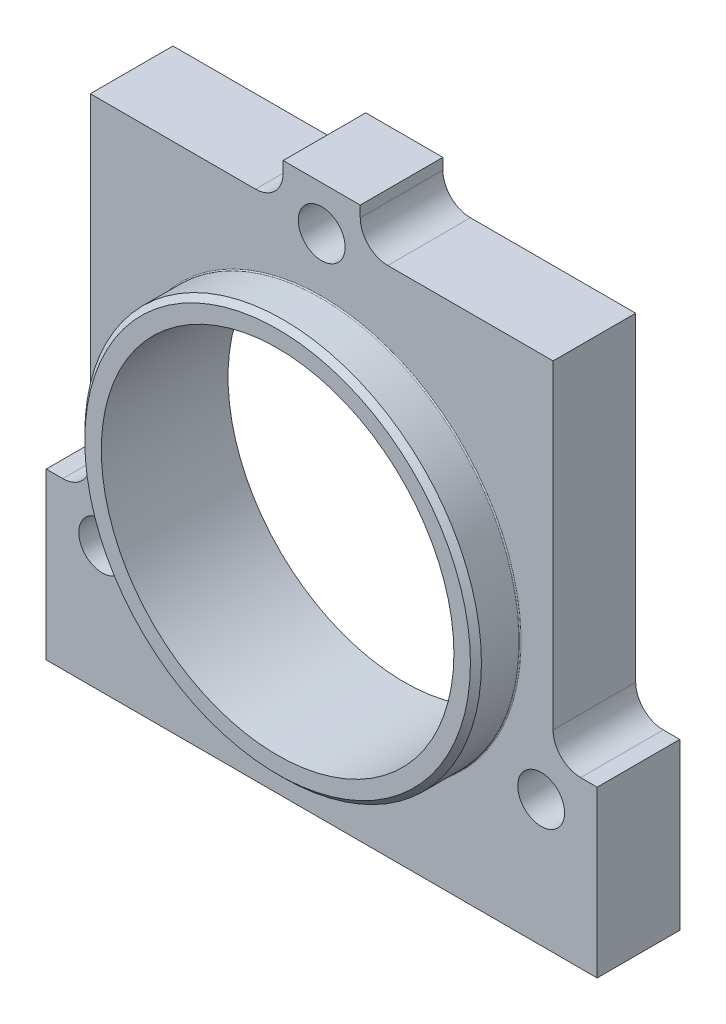
ISO-10303-21;
HEADER;
FILE_DESCRIPTION(('STEP AP214'),'2;1');
FILE_NAME('part.step','',(''),(''),'','','');
FILE_SCHEMA(('AUTOMOTIVE_DESIGN { 1 0 10303 214 1 1 1 1 }'));
ENDSEC;
DATA;
#1=APPLICATION_CONTEXT('core data for automotive mechanical design processes');
#2=APPLICATION_PROTOCOL_DEFINITION('international standard','automotive_design',2000,#1);
#3=PRODUCT_CONTEXT('',#1,'mechanical');
#4=PRODUCT('Part','Part','',(#3));
#5=PRODUCT_RELATED_PRODUCT_CATEGORY('part','',(#4));
#6=PRODUCT_DEFINITION_FORMATION('','',#4);
#7=PRODUCT_DEFINITION_CONTEXT('part definition',#1,'design');
#8=PRODUCT_DEFINITION('design','',#6,#7);
#9=PRODUCT_DEFINITION_SHAPE('','',#8);
#10=(LENGTH_UNIT() NAMED_UNIT(*) SI_UNIT(.MILLI.,.METRE.));
#11=(NAMED_UNIT(*) PLANE_ANGLE_UNIT() SI_UNIT($,.RADIAN.));
#12=(NAMED_UNIT(*) SI_UNIT($,.STERADIAN.) SOLID_ANGLE_UNIT());
#13=UNCERTAINTY_MEASURE_WITH_UNIT(LENGTH_MEASURE(1.E-05),#10,'distance_accuracy_value','');
#14=(GEOMETRIC_REPRESENTATION_CONTEXT(3) GLOBAL_UNCERTAINTY_ASSIGNED_CONTEXT((#13)) GLOBAL_UNIT_ASSIGNED_CONTEXT((#10,
#11,#12)) REPRESENTATION_CONTEXT('',''));
#15=CARTESIAN_POINT('',(0.,0.,0.));
#16=DIRECTION('',(0.,0.,1.));
#17=DIRECTION('',(1.,0.,0.));
#18=AXIS2_PLACEMENT_3D('',#15,#16,#17);
#19=CARTESIAN_POINT('',(-39.8371685740844,-22.9999999999996,23.));
#20=DIRECTION('',(0.,0.,-1.));
#21=DIRECTION('',(-1.,0.,0.));
#22=AXIS2_PLACEMENT_3D('',#19,#20,#21);
#23=CYLINDRICAL_SURFACE('',#22,4.25);
#24=CARTESIAN_POINT('',(-39.8371685740844,-22.9999999999996,15.));
#25=DIRECTION('',(0.,0.,-1.));
#26=DIRECTION('',(-1.,0.,0.));
#27=AXIS2_PLACEMENT_3D('',#24,#25,#26);
#28=CIRCLE('',#27,4.25);
#29=CARTESIAN_POINT('',(-44.0871685740844,-22.9999999999996,15.));
#30=VERTEX_POINT('',#29);
#31=EDGE_CURVE('E269',#30,#30,#28,.T.);
#32=ORIENTED_EDGE('',*,*,#31,.F.);
#33=EDGE_LOOP('',(#32));
#34=FACE_BOUND('',#33,.T.);
#35=CARTESIAN_POINT('',(-39.8371685740844,-22.9999999999996,8.));
#36=DIRECTION('',(0.,0.,-1.));
#37=DIRECTION('',(-1.,0.,0.));
#38=AXIS2_PLACEMENT_3D('',#35,#36,#37);
#39=CIRCLE('',#38,4.25);
#40=CARTESIAN_POINT('',(-44.0871685740844,-22.9999999999996,8.));
#41=VERTEX_POINT('',#40);
#42=EDGE_CURVE('E41',#41,#41,#39,.F.);
#43=ORIENTED_EDGE('',*,*,#42,.F.);
#44=EDGE_LOOP('',(#43));
#45=FACE_BOUND('',#44,.T.);
#46=ADVANCED_FACE('F37',(#34,#45),#23,.F.);
#47=CARTESIAN_POINT('',(39.8371685740841,-23.0000000000002,23.));
#48=DIRECTION('',(0.,0.,-1.));
#49=DIRECTION('',(-1.,0.,0.));
#50=AXIS2_PLACEMENT_3D('',#47,#48,#49);
#51=CYLINDRICAL_SURFACE('',#50,4.25);
#52=CARTESIAN_POINT('',(39.8371685740841,-23.0000000000002,15.));
#53=DIRECTION('',(0.,0.,-1.));
#54=DIRECTION('',(-1.,0.,0.));
#55=AXIS2_PLACEMENT_3D('',#52,#53,#54);
#56=CIRCLE('',#55,4.25);
#57=CARTESIAN_POINT('',(35.5871685740841,-23.0000000000002,15.));
#58=VERTEX_POINT('',#57);
#59=EDGE_CURVE('E274',#58,#58,#56,.T.);
#60=ORIENTED_EDGE('',*,*,#59,.F.);
#61=EDGE_LOOP('',(#60));
#62=FACE_BOUND('',#61,.T.);
#63=CARTESIAN_POINT('',(39.8371685740841,-23.0000000000002,8.));
#64=DIRECTION('',(0.,0.,-1.));
#65=DIRECTION('',(-1.,0.,0.));
#66=AXIS2_PLACEMENT_3D('',#63,#64,#65);
#67=CIRCLE('',#66,4.25);
#68=CARTESIAN_POINT('',(35.5871685740841,-23.0000000000002,8.));
#69=VERTEX_POINT('',#68);
#70=EDGE_CURVE('E267',#69,#69,#67,.F.);
#71=ORIENTED_EDGE('',*,*,#70,.F.);
#72=EDGE_LOOP('',(#71));
#73=FACE_BOUND('',#72,.T.);
#74=ADVANCED_FACE('F355',(#62,#73),#51,.F.);
#75=CARTESIAN_POINT('',(0.,46.,23.));
#76=DIRECTION('',(0.,0.,-1.));
#77=DIRECTION('',(-1.,0.,0.));
#78=AXIS2_PLACEMENT_3D('',#75,#76,#77);
#79=CYLINDRICAL_SURFACE('',#78,4.25);
#80=CARTESIAN_POINT('',(0.,46.,15.));
#81=DIRECTION('',(0.,0.,-1.));
#82=DIRECTION('',(-1.,0.,0.));
#83=AXIS2_PLACEMENT_3D('',#80,#81,#82);
#84=CIRCLE('',#83,4.25);
#85=CARTESIAN_POINT('',(-4.25,46.,15.));
#86=VERTEX_POINT('',#85);
#87=EDGE_CURVE('E265',#86,#86,#84,.T.);
#88=ORIENTED_EDGE('',*,*,#87,.F.);
#89=EDGE_LOOP('',(#88));
#90=FACE_BOUND('',#89,.T.);
#91=CARTESIAN_POINT('',(0.,46.,8.));
#92=DIRECTION('',(0.,0.,-1.));
#93=DIRECTION('',(-1.,0.,0.));
#94=AXIS2_PLACEMENT_3D('',#91,#92,#93);
#95=CIRCLE('',#94,4.25);
#96=CARTESIAN_POINT('',(-4.25,46.,8.));
#97=VERTEX_POINT('',#96);
#98=EDGE_CURVE('E263',#97,#97,#95,.F.);
#99=ORIENTED_EDGE('',*,*,#98,.F.);
#100=EDGE_LOOP('',(#99));
#101=FACE_BOUND('',#100,.T.);
#102=ADVANCED_FACE('F361',(#90,#101),#79,.F.);
#103=CARTESIAN_POINT('',(12.,52.,15.));
#104=DIRECTION('',(0.,0.,-1.));
#105=DIRECTION('',(-1.,0.,0.));
#106=AXIS2_PLACEMENT_3D('',#103,#104,#105);
#107=PLANE('',#106);
#108=ORIENTED_EDGE('',*,*,#31,.T.);
#109=EDGE_LOOP('',(#108));
#110=FACE_BOUND('',#109,.T.);
#111=ORIENTED_EDGE('',*,*,#59,.T.);
#112=EDGE_LOOP('',(#111));
#113=FACE_BOUND('',#112,.T.);
#114=ORIENTED_EDGE('',*,*,#87,.T.);
#115=EDGE_LOOP('',(#114));
#116=FACE_BOUND('',#115,.T.);
#117=CARTESIAN_POINT('',(0.,0.,15.));
#118=DIRECTION('',(0.,0.,-1.));
#119=DIRECTION('',(-1.,0.,0.));
#120=AXIS2_PLACEMENT_3D('',#117,#118,#119);
#121=CIRCLE('',#120,36.2);
#122=CARTESIAN_POINT('',(-36.2,0.,15.));
#123=VERTEX_POINT('',#122);
#124=EDGE_CURVE('E11',#123,#123,#121,.T.);
#125=ORIENTED_EDGE('',*,*,#124,.T.);
#126=EDGE_LOOP('',(#125));
#127=FACE_BOUND('',#126,.T.);
#128=DIRECTION('',(0.,-1.,0.));
#129=VECTOR('',#128,1.);
#130=CARTESIAN_POINT('',(-6.99999999999999,52.,15.));
#131=LINE('',#130,#129);
#132=CARTESIAN_POINT('',(-6.99999999999999,54.,15.));
#133=VERTEX_POINT('',#132);
#134=CARTESIAN_POINT('',(-6.99999999999999,52.,15.));
#135=VERTEX_POINT('',#134);
#136=EDGE_CURVE('E216',#133,#135,#131,.T.);
#137=ORIENTED_EDGE('',*,*,#136,.T.);
#138=CARTESIAN_POINT('',(-12.,52.,15.));
#139=DIRECTION('',(0.,0.,-1.));
#140=DIRECTION('',(1.,0.,0.));
#141=AXIS2_PLACEMENT_3D('',#138,#139,#140);
#142=CIRCLE('',#141,5.);
#143=CARTESIAN_POINT('',(-12.,47.,15.));
#144=VERTEX_POINT('',#143);
#145=EDGE_CURVE('E124',#135,#144,#142,.T.);
#146=ORIENTED_EDGE('',*,*,#145,.T.);
#147=DIRECTION('',(-1.,0.,0.));
#148=VECTOR('',#147,1.);
#149=CARTESIAN_POINT('',(-42.,47.,15.));
#150=LINE('',#149,#148);
#151=CARTESIAN_POINT('',(-42.,47.,15.));
#152=VERTEX_POINT('',#151);
#153=EDGE_CURVE('E303',#144,#152,#150,.T.);
#154=ORIENTED_EDGE('',*,*,#153,.T.);
#155=DIRECTION('',(0.,-1.,0.));
#156=VECTOR('',#155,1.);
#157=CARTESIAN_POINT('',(-42.,-11.,15.));
#158=LINE('',#157,#156);
#159=CARTESIAN_POINT('',(-42.,-11.,15.));
#160=VERTEX_POINT('',#159);
#161=EDGE_CURVE('E305',#152,#160,#158,.T.);
#162=ORIENTED_EDGE('',*,*,#161,.T.);
#163=CARTESIAN_POINT('',(-47.,-11.,15.));
#164=DIRECTION('',(0.,0.,-1.));
#165=DIRECTION('',(1.,0.,0.));
#166=AXIS2_PLACEMENT_3D('',#163,#164,#165);
#167=CIRCLE('',#166,5.);
#168=CARTESIAN_POINT('',(-47.,-16.,15.));
#169=VERTEX_POINT('',#168);
#170=EDGE_CURVE('E307',#160,#169,#167,.T.);
#171=ORIENTED_EDGE('',*,*,#170,.T.);
#172=DIRECTION('',(-1.,0.,0.));
#173=VECTOR('',#172,1.);
#174=CARTESIAN_POINT('',(-50.,-16.,15.));
#175=LINE('',#174,#173);
#176=CARTESIAN_POINT('',(-50.,-16.,15.));
#177=VERTEX_POINT('',#176);
#178=EDGE_CURVE('E309',#169,#177,#175,.T.);
#179=ORIENTED_EDGE('',*,*,#178,.T.);
#180=DIRECTION('',(0.,-1.,0.));
#181=VECTOR('',#180,1.);
#182=CARTESIAN_POINT('',(-50.,-46.,15.));
#183=LINE('',#182,#181);
#184=CARTESIAN_POINT('',(-50.,-46.,15.));
#185=VERTEX_POINT('',#184);
#186=EDGE_CURVE('E311',#177,#185,#183,.T.);
#187=ORIENTED_EDGE('',*,*,#186,.T.);
#188=DIRECTION('',(1.,0.,0.));
#189=VECTOR('',#188,1.);
#190=CARTESIAN_POINT('',(50.,-46.,15.));
#191=LINE('',#190,#189);
#192=CARTESIAN_POINT('',(50.,-46.,15.));
#193=VERTEX_POINT('',#192);
#194=EDGE_CURVE('E313',#185,#193,#191,.T.);
#195=ORIENTED_EDGE('',*,*,#194,.T.);
#196=DIRECTION('',(0.,1.,0.));
#197=VECTOR('',#196,1.);
#198=CARTESIAN_POINT('',(50.,-16.,15.));
#199=LINE('',#198,#197);
#200=CARTESIAN_POINT('',(50.,-16.,15.));
#201=VERTEX_POINT('',#200);
#202=EDGE_CURVE('E315',#193,#201,#199,.T.);
#203=ORIENTED_EDGE('',*,*,#202,.T.);
#204=DIRECTION('',(-1.,0.,0.));
#205=VECTOR('',#204,1.);
#206=CARTESIAN_POINT('',(47.0000000000001,-16.,15.));
#207=LINE('',#206,#205);
#208=CARTESIAN_POINT('',(47.0000000000001,-16.,15.));
#209=VERTEX_POINT('',#208);
#210=EDGE_CURVE('E317',#201,#209,#207,.T.);
#211=ORIENTED_EDGE('',*,*,#210,.T.);
#212=CARTESIAN_POINT('',(47.,-11.,15.));
#213=DIRECTION('',(0.,0.,-1.));
#214=DIRECTION('',(1.,0.,0.));
#215=AXIS2_PLACEMENT_3D('',#212,#213,#214);
#216=CIRCLE('',#215,5.);
#217=CARTESIAN_POINT('',(42.,-11.,15.));
#218=VERTEX_POINT('',#217);
#219=EDGE_CURVE('E319',#209,#218,#216,.T.);
#220=ORIENTED_EDGE('',*,*,#219,.T.);
#221=DIRECTION('',(0.,1.,0.));
#222=VECTOR('',#221,1.);
#223=CARTESIAN_POINT('',(42.,47.,15.));
#224=LINE('',#223,#222);
#225=CARTESIAN_POINT('',(42.,47.,15.));
#226=VERTEX_POINT('',#225);
#227=EDGE_CURVE('E321',#218,#226,#224,.T.);
#228=ORIENTED_EDGE('',*,*,#227,.T.);
#229=DIRECTION('',(-1.,0.,0.));
#230=VECTOR('',#229,1.);
#231=CARTESIAN_POINT('',(12.,47.,15.));
#232=LINE('',#231,#230);
#233=CARTESIAN_POINT('',(12.,47.,15.));
#234=VERTEX_POINT('',#233);
#235=EDGE_CURVE('E167',#226,#234,#232,.T.);
#236=ORIENTED_EDGE('',*,*,#235,.T.);
#237=CARTESIAN_POINT('',(12.,52.,15.));
#238=DIRECTION('',(0.,0.,-1.));
#239=DIRECTION('',(-1.,0.,0.));
#240=AXIS2_PLACEMENT_3D('',#237,#238,#239);
#241=CIRCLE('',#240,5.);
#242=CARTESIAN_POINT('',(7.00000000000001,52.,15.));
#243=VERTEX_POINT('',#242);
#244=EDGE_CURVE('E161',#234,#243,#241,.T.);
#245=ORIENTED_EDGE('',*,*,#244,.T.);
#246=DIRECTION('',(0.,1.,0.));
#247=VECTOR('',#246,1.);
#248=CARTESIAN_POINT('',(7.,54.,15.));
#249=LINE('',#248,#247);
#250=CARTESIAN_POINT('',(7.,54.,15.));
#251=VERTEX_POINT('',#250);
#252=EDGE_CURVE('E165',#243,#251,#249,.T.);
#253=ORIENTED_EDGE('',*,*,#252,.T.);
#254=DIRECTION('',(-1.,0.,0.));
#255=VECTOR('',#254,1.);
#256=CARTESIAN_POINT('',(-6.99999999999999,54.,15.));
#257=LINE('',#256,#255);
#258=EDGE_CURVE('E56',#251,#133,#257,.T.);
#259=ORIENTED_EDGE('',*,*,#258,.T.);
#260=EDGE_LOOP('',(#137,#146,#154,#162,#171,#179,#187,#195,#203,#211,#220,#228,#236,#245,#253,#259));
#261=FACE_BOUND('',#260,.T.);
#262=ADVANCED_FACE('F163',(#110,#113,#116,#127,#261),#107,.F.);
#263=CARTESIAN_POINT('',(12.,52.,0.));
#264=DIRECTION('',(0.,0.,-1.));
#265=DIRECTION('',(-1.,0.,0.));
#266=AXIS2_PLACEMENT_3D('',#263,#264,#265);
#267=PLANE('',#266);
#268=CARTESIAN_POINT('',(-39.8371685740844,-22.9999999999996,0.));
#269=DIRECTION('',(0.,0.,-1.));
#270=DIRECTION('',(0.499999999999992,-0.866025403784443,0.));
#271=AXIS2_PLACEMENT_3D('',#268,#269,#270);
#272=CIRCLE('',#271,7.);
#273=CARTESIAN_POINT('',(-36.3371685740845,-29.0621778264907,0.));
#274=VERTEX_POINT('',#273);
#275=EDGE_CURVE('E284',#274,#274,#272,.T.);
#276=ORIENTED_EDGE('',*,*,#275,.F.);
#277=EDGE_LOOP('',(#276));
#278=FACE_BOUND('',#277,.T.);
#279=CARTESIAN_POINT('',(39.8371685740841,-23.0000000000002,0.));
#280=DIRECTION('',(0.,0.,-1.));
#281=DIRECTION('',(0.500000000000004,0.866025403784436,0.));
#282=AXIS2_PLACEMENT_3D('',#279,#280,#281);
#283=CIRCLE('',#282,7.);
#284=CARTESIAN_POINT('',(43.3371685740841,-16.9378221735091,0.));
#285=VERTEX_POINT('',#284);
#286=EDGE_CURVE('E277',#285,#285,#283,.T.);
#287=ORIENTED_EDGE('',*,*,#286,.F.);
#288=EDGE_LOOP('',(#287));
#289=FACE_BOUND('',#288,.T.);
#290=CARTESIAN_POINT('',(0.,46.,0.));
#291=DIRECTION('',(0.,0.,-1.));
#292=DIRECTION('',(-1.,0.,0.));
#293=AXIS2_PLACEMENT_3D('',#290,#291,#292);
#294=CIRCLE('',#293,7.);
#295=CARTESIAN_POINT('',(-7.,46.,0.));
#296=VERTEX_POINT('',#295);
#297=EDGE_CURVE('E289',#296,#296,#294,.T.);
#298=ORIENTED_EDGE('',*,*,#297,.F.);
#299=EDGE_LOOP('',(#298));
#300=FACE_BOUND('',#299,.T.);
#301=DIRECTION('',(0.,-1.,0.));
#302=VECTOR('',#301,1.);
#303=CARTESIAN_POINT('',(-6.99999999999999,52.,0.));
#304=LINE('',#303,#302);
#305=CARTESIAN_POINT('',(-6.99999999999999,54.,0.));
#306=VERTEX_POINT('',#305);
#307=CARTESIAN_POINT('',(-6.99999999999999,52.,0.));
#308=VERTEX_POINT('',#307);
#309=EDGE_CURVE('E185',#306,#308,#304,.T.);
#310=ORIENTED_EDGE('',*,*,#309,.F.);
#311=DIRECTION('',(-1.,0.,0.));
#312=VECTOR('',#311,1.);
#313=CARTESIAN_POINT('',(-6.99999999999999,54.,0.));
#314=LINE('',#313,#312);
#315=CARTESIAN_POINT('',(7.,54.,0.));
#316=VERTEX_POINT('',#315);
#317=EDGE_CURVE('E115',#316,#306,#314,.T.);
#318=ORIENTED_EDGE('',*,*,#317,.F.);
#319=DIRECTION('',(0.,1.,0.));
#320=VECTOR('',#319,1.);
#321=CARTESIAN_POINT('',(7.,54.,0.));
#322=LINE('',#321,#320);
#323=CARTESIAN_POINT('',(7.00000000000001,52.,0.));
#324=VERTEX_POINT('',#323);
#325=EDGE_CURVE('E109',#324,#316,#322,.T.);
#326=ORIENTED_EDGE('',*,*,#325,.F.);
#327=CARTESIAN_POINT('',(12.,52.,0.));
#328=DIRECTION('',(0.,0.,-1.));
#329=DIRECTION('',(-1.,0.,0.));
#330=AXIS2_PLACEMENT_3D('',#327,#328,#329);
#331=CIRCLE('',#330,5.);
#332=CARTESIAN_POINT('',(12.,47.,0.));
#333=VERTEX_POINT('',#332);
#334=EDGE_CURVE('E175',#333,#324,#331,.T.);
#335=ORIENTED_EDGE('',*,*,#334,.F.);
#336=DIRECTION('',(-1.,0.,0.));
#337=VECTOR('',#336,1.);
#338=CARTESIAN_POINT('',(12.,47.,0.));
#339=LINE('',#338,#337);
#340=CARTESIAN_POINT('',(42.,47.,0.));
#341=VERTEX_POINT('',#340);
#342=EDGE_CURVE('E211',#341,#333,#339,.T.);
#343=ORIENTED_EDGE('',*,*,#342,.F.);
#344=DIRECTION('',(0.,1.,0.));
#345=VECTOR('',#344,1.);
#346=CARTESIAN_POINT('',(42.,47.,0.));
#347=LINE('',#346,#345);
#348=CARTESIAN_POINT('',(42.,-11.,0.));
#349=VERTEX_POINT('',#348);
#350=EDGE_CURVE('E209',#349,#341,#347,.T.);
#351=ORIENTED_EDGE('',*,*,#350,.F.);
#352=CARTESIAN_POINT('',(47.,-11.,0.));
#353=DIRECTION('',(0.,0.,-1.));
#354=DIRECTION('',(1.,0.,0.));
#355=AXIS2_PLACEMENT_3D('',#352,#353,#354);
#356=CIRCLE('',#355,5.);
#357=CARTESIAN_POINT('',(47.0000000000001,-16.,0.));
#358=VERTEX_POINT('',#357);
#359=EDGE_CURVE('E207',#358,#349,#356,.T.);
#360=ORIENTED_EDGE('',*,*,#359,.F.);
#361=DIRECTION('',(-1.,0.,0.));
#362=VECTOR('',#361,1.);
#363=CARTESIAN_POINT('',(47.0000000000001,-16.,0.));
#364=LINE('',#363,#362);
#365=CARTESIAN_POINT('',(50.,-16.,0.));
#366=VERTEX_POINT('',#365);
#367=EDGE_CURVE('E205',#366,#358,#364,.T.);
#368=ORIENTED_EDGE('',*,*,#367,.F.);
#369=DIRECTION('',(0.,1.,0.));
#370=VECTOR('',#369,1.);
#371=CARTESIAN_POINT('',(50.,-16.,0.));
#372=LINE('',#371,#370);
#373=CARTESIAN_POINT('',(50.,-46.,0.));
#374=VERTEX_POINT('',#373);
#375=EDGE_CURVE('E203',#374,#366,#372,.T.);
#376=ORIENTED_EDGE('',*,*,#375,.F.);
#377=DIRECTION('',(1.,0.,0.));
#378=VECTOR('',#377,1.);
#379=CARTESIAN_POINT('',(50.,-46.,0.));
#380=LINE('',#379,#378);
#381=CARTESIAN_POINT('',(-50.,-46.,0.));
#382=VERTEX_POINT('',#381);
#383=EDGE_CURVE('E201',#382,#374,#380,.T.);
#384=ORIENTED_EDGE('',*,*,#383,.F.);
#385=DIRECTION('',(0.,-1.,0.));
#386=VECTOR('',#385,1.);
#387=CARTESIAN_POINT('',(-50.,-46.,0.));
#388=LINE('',#387,#386);
#389=CARTESIAN_POINT('',(-50.,-16.,0.));
#390=VERTEX_POINT('',#389);
#391=EDGE_CURVE('E199',#390,#382,#388,.T.);
#392=ORIENTED_EDGE('',*,*,#391,.F.);
#393=DIRECTION('',(-1.,0.,0.));
#394=VECTOR('',#393,1.);
#395=CARTESIAN_POINT('',(-50.,-16.,0.));
#396=LINE('',#395,#394);
#397=CARTESIAN_POINT('',(-47.,-16.,0.));
#398=VERTEX_POINT('',#397);
#399=EDGE_CURVE('E197',#398,#390,#396,.T.);
#400=ORIENTED_EDGE('',*,*,#399,.F.);
#401=CARTESIAN_POINT('',(-47.,-11.,0.));
#402=DIRECTION('',(0.,0.,-1.));
#403=DIRECTION('',(1.,0.,0.));
#404=AXIS2_PLACEMENT_3D('',#401,#402,#403);
#405=CIRCLE('',#404,5.);
#406=CARTESIAN_POINT('',(-42.,-11.,0.));
#407=VERTEX_POINT('',#406);
#408=EDGE_CURVE('E195',#407,#398,#405,.T.);
#409=ORIENTED_EDGE('',*,*,#408,.F.);
#410=DIRECTION('',(0.,-1.,0.));
#411=VECTOR('',#410,1.);
#412=CARTESIAN_POINT('',(-42.,-11.,0.));
#413=LINE('',#412,#411);
#414=CARTESIAN_POINT('',(-42.,47.,0.));
#415=VERTEX_POINT('',#414);
#416=EDGE_CURVE('E193',#415,#407,#413,.T.);
#417=ORIENTED_EDGE('',*,*,#416,.F.);
#418=DIRECTION('',(-1.,0.,0.));
#419=VECTOR('',#418,1.);
#420=CARTESIAN_POINT('',(-42.,47.,0.));
#421=LINE('',#420,#419);
#422=CARTESIAN_POINT('',(-12.,47.,0.));
#423=VERTEX_POINT('',#422);
#424=EDGE_CURVE('E191',#423,#415,#421,.T.);
#425=ORIENTED_EDGE('',*,*,#424,.F.);
#426=CARTESIAN_POINT('',(-12.,52.,0.));
#427=DIRECTION('',(0.,0.,-1.));
#428=DIRECTION('',(1.,0.,0.));
#429=AXIS2_PLACEMENT_3D('',#426,#427,#428);
#430=CIRCLE('',#429,5.);
#431=EDGE_CURVE('E188',#308,#423,#430,.T.);
#432=ORIENTED_EDGE('',*,*,#431,.F.);
#433=EDGE_LOOP('',(#310,#318,#326,#335,#343,#351,#360,#368,#376,#384,#392,#400,#409,#417,#425,#432));
#434=FACE_BOUND('',#433,.T.);
#435=CARTESIAN_POINT('',(0.,0.,0.));
#436=DIRECTION('',(0.,0.,1.));
#437=DIRECTION('',(1.,0.,0.));
#438=AXIS2_PLACEMENT_3D('',#435,#436,#437);
#439=CIRCLE('',#438,32.);
#440=CARTESIAN_POINT('',(32.,0.,0.));
#441=VERTEX_POINT('',#440);
#442=EDGE_CURVE('E189',#441,#441,#439,.T.);
#443=ORIENTED_EDGE('',*,*,#442,.T.);
#444=EDGE_LOOP('',(#443));
#445=FACE_BOUND('',#444,.T.);
#446=ADVANCED_FACE('F334',(#278,#289,#300,#434,#445),#267,.T.);
#447=CARTESIAN_POINT('',(-6.99999999999999,52.,15.));
#448=DIRECTION('',(1.,0.,0.));
#449=DIRECTION('',(0.,1.,0.));
#450=AXIS2_PLACEMENT_3D('',#447,#448,#449);
#451=PLANE('',#450);
#452=ORIENTED_EDGE('',*,*,#309,.T.);
#453=DIRECTION('',(0.,0.,-1.));
#454=VECTOR('',#453,1.);
#455=CARTESIAN_POINT('',(-6.99999999999999,52.,15.));
#456=LINE('',#455,#454);
#457=EDGE_CURVE('E253',#135,#308,#456,.T.);
#458=ORIENTED_EDGE('',*,*,#457,.F.);
#459=ORIENTED_EDGE('',*,*,#136,.F.);
#460=DIRECTION('',(0.,0.,-1.));
#461=VECTOR('',#460,1.);
#462=CARTESIAN_POINT('',(-6.99999999999999,54.,15.));
#463=LINE('',#462,#461);
#464=EDGE_CURVE('E181',#133,#306,#463,.T.);
#465=ORIENTED_EDGE('',*,*,#464,.T.);
#466=EDGE_LOOP('',(#452,#458,#459,#465));
#467=FACE_BOUND('',#466,.T.);
#468=ADVANCED_FACE('F339',(#467),#451,.F.);
#469=CARTESIAN_POINT('',(-12.,52.,15.));
#470=DIRECTION('',(0.,0.,-1.));
#471=DIRECTION('',(-1.,0.,0.));
#472=AXIS2_PLACEMENT_3D('',#469,#470,#471);
#473=CYLINDRICAL_SURFACE('',#472,5.);
#474=ORIENTED_EDGE('',*,*,#431,.T.);
#475=DIRECTION('',(0.,0.,-1.));
#476=VECTOR('',#475,1.);
#477=CARTESIAN_POINT('',(-12.,47.,15.));
#478=LINE('',#477,#476);
#479=EDGE_CURVE('E250',#144,#423,#478,.T.);
#480=ORIENTED_EDGE('',*,*,#479,.F.);
#481=ORIENTED_EDGE('',*,*,#145,.F.);
#482=ORIENTED_EDGE('',*,*,#457,.T.);
#483=EDGE_LOOP('',(#474,#480,#481,#482));
#484=FACE_BOUND('',#483,.T.);
#485=ADVANCED_FACE('F397',(#484),#473,.F.);
#486=CARTESIAN_POINT('',(-42.,47.,15.));
#487=DIRECTION('',(0.,-1.,0.));
#488=DIRECTION('',(0.,0.,-1.));
#489=AXIS2_PLACEMENT_3D('',#486,#487,#488);
#490=PLANE('',#489);
#491=ORIENTED_EDGE('',*,*,#424,.T.);
#492=DIRECTION('',(0.,0.,-1.));
#493=VECTOR('',#492,1.);
#494=CARTESIAN_POINT('',(-42.,47.,15.));
#495=LINE('',#494,#493);
#496=EDGE_CURVE('E247',#152,#415,#495,.T.);
#497=ORIENTED_EDGE('',*,*,#496,.F.);
#498=ORIENTED_EDGE('',*,*,#153,.F.);
#499=ORIENTED_EDGE('',*,*,#479,.T.);
#500=EDGE_LOOP('',(#491,#497,#498,#499));
#501=FACE_BOUND('',#500,.T.);
#502=ADVANCED_FACE('F631',(#501),#490,.F.);
#503=CARTESIAN_POINT('',(-42.,-11.,15.));
#504=DIRECTION('',(1.,0.,0.));
#505=DIRECTION('',(0.,1.,0.));
#506=AXIS2_PLACEMENT_3D('',#503,#504,#505);
#507=PLANE('',#506);
#508=ORIENTED_EDGE('',*,*,#416,.T.);
#509=DIRECTION('',(0.,0.,-1.));
#510=VECTOR('',#509,1.);
#511=CARTESIAN_POINT('',(-42.,-11.,15.));
#512=LINE('',#511,#510);
#513=EDGE_CURVE('E244',#160,#407,#512,.T.);
#514=ORIENTED_EDGE('',*,*,#513,.F.);
#515=ORIENTED_EDGE('',*,*,#161,.F.);
#516=ORIENTED_EDGE('',*,*,#496,.T.);
#517=EDGE_LOOP('',(#508,#514,#515,#516));
#518=FACE_BOUND('',#517,.T.);
#519=ADVANCED_FACE('F621',(#518),#507,.F.);
#520=CARTESIAN_POINT('',(-47.,-11.,15.));
#521=DIRECTION('',(0.,0.,-1.));
#522=DIRECTION('',(-1.,0.,0.));
#523=AXIS2_PLACEMENT_3D('',#520,#521,#522);
#524=CYLINDRICAL_SURFACE('',#523,5.);
#525=ORIENTED_EDGE('',*,*,#408,.T.);
#526=DIRECTION('',(0.,0.,-1.));
#527=VECTOR('',#526,1.);
#528=CARTESIAN_POINT('',(-47.,-16.,15.));
#529=LINE('',#528,#527);
#530=EDGE_CURVE('E241',#169,#398,#529,.T.);
#531=ORIENTED_EDGE('',*,*,#530,.F.);
#532=ORIENTED_EDGE('',*,*,#170,.F.);
#533=ORIENTED_EDGE('',*,*,#513,.T.);
#534=EDGE_LOOP('',(#525,#531,#532,#533));
#535=FACE_BOUND('',#534,.T.);
#536=ADVANCED_FACE('F611',(#535),#524,.F.);
#537=CARTESIAN_POINT('',(-50.,-16.,15.));
#538=DIRECTION('',(0.,-1.,0.));
#539=DIRECTION('',(0.,0.,-1.));
#540=AXIS2_PLACEMENT_3D('',#537,#538,#539);
#541=PLANE('',#540);
#542=ORIENTED_EDGE('',*,*,#399,.T.);
#543=DIRECTION('',(0.,0.,-1.));
#544=VECTOR('',#543,1.);
#545=CARTESIAN_POINT('',(-50.,-16.,15.));
#546=LINE('',#545,#544);
#547=EDGE_CURVE('E238',#177,#390,#546,.T.);
#548=ORIENTED_EDGE('',*,*,#547,.F.);
#549=ORIENTED_EDGE('',*,*,#178,.F.);
#550=ORIENTED_EDGE('',*,*,#530,.T.);
#551=EDGE_LOOP('',(#542,#548,#549,#550));
#552=FACE_BOUND('',#551,.T.);
#553=ADVANCED_FACE('F601',(#552),#541,.F.);
#554=CARTESIAN_POINT('',(-50.,-46.,15.));
#555=DIRECTION('',(1.,0.,0.));
#556=DIRECTION('',(0.,1.,0.));
#557=AXIS2_PLACEMENT_3D('',#554,#555,#556);
#558=PLANE('',#557);
#559=ORIENTED_EDGE('',*,*,#391,.T.);
#560=DIRECTION('',(0.,0.,-1.));
#561=VECTOR('',#560,1.);
#562=CARTESIAN_POINT('',(-50.,-46.,15.));
#563=LINE('',#562,#561);
#564=EDGE_CURVE('E235',#185,#382,#563,.T.);
#565=ORIENTED_EDGE('',*,*,#564,.F.);
#566=ORIENTED_EDGE('',*,*,#186,.F.);
#567=ORIENTED_EDGE('',*,*,#547,.T.);
#568=EDGE_LOOP('',(#559,#565,#566,#567));
#569=FACE_BOUND('',#568,.T.);
#570=ADVANCED_FACE('F591',(#569),#558,.F.);
#571=CARTESIAN_POINT('',(50.,-46.,15.));
#572=DIRECTION('',(0.,1.,0.));
#573=DIRECTION('',(-1.,0.,0.));
#574=AXIS2_PLACEMENT_3D('',#571,#572,#573);
#575=PLANE('',#574);
#576=ORIENTED_EDGE('',*,*,#383,.T.);
#577=DIRECTION('',(0.,0.,-1.));
#578=VECTOR('',#577,1.);
#579=CARTESIAN_POINT('',(50.,-46.,15.));
#580=LINE('',#579,#578);
#581=EDGE_CURVE('E232',#193,#374,#580,.T.);
#582=ORIENTED_EDGE('',*,*,#581,.F.);
#583=ORIENTED_EDGE('',*,*,#194,.F.);
#584=ORIENTED_EDGE('',*,*,#564,.T.);
#585=EDGE_LOOP('',(#576,#582,#583,#584));
#586=FACE_BOUND('',#585,.T.);
#587=ADVANCED_FACE('F581',(#586),#575,.F.);
#588=CARTESIAN_POINT('',(50.,-16.,15.));
#589=DIRECTION('',(-1.,0.,0.));
#590=DIRECTION('',(0.,-1.,0.));
#591=AXIS2_PLACEMENT_3D('',#588,#589,#590);
#592=PLANE('',#591);
#593=ORIENTED_EDGE('',*,*,#375,.T.);
#594=DIRECTION('',(0.,0.,-1.));
#595=VECTOR('',#594,1.);
#596=CARTESIAN_POINT('',(50.,-16.,15.));
#597=LINE('',#596,#595);
#598=EDGE_CURVE('E229',#201,#366,#597,.T.);
#599=ORIENTED_EDGE('',*,*,#598,.F.);
#600=ORIENTED_EDGE('',*,*,#202,.F.);
#601=ORIENTED_EDGE('',*,*,#581,.T.);
#602=EDGE_LOOP('',(#593,#599,#600,#601));
#603=FACE_BOUND('',#602,.T.);
#604=ADVANCED_FACE('F571',(#603),#592,.F.);
#605=CARTESIAN_POINT('',(47.0000000000001,-16.,15.));
#606=DIRECTION('',(0.,-1.,0.));
#607=DIRECTION('',(0.,0.,-1.));
#608=AXIS2_PLACEMENT_3D('',#605,#606,#607);
#609=PLANE('',#608);
#610=ORIENTED_EDGE('',*,*,#367,.T.);
#611=DIRECTION('',(0.,0.,-1.));
#612=VECTOR('',#611,1.);
#613=CARTESIAN_POINT('',(47.0000000000001,-16.,15.));
#614=LINE('',#613,#612);
#615=EDGE_CURVE('E226',#209,#358,#614,.T.);
#616=ORIENTED_EDGE('',*,*,#615,.F.);
#617=ORIENTED_EDGE('',*,*,#210,.F.);
#618=ORIENTED_EDGE('',*,*,#598,.T.);
#619=EDGE_LOOP('',(#610,#616,#617,#618));
#620=FACE_BOUND('',#619,.T.);
#621=ADVANCED_FACE('F561',(#620),#609,.F.);
#622=CARTESIAN_POINT('',(47.,-11.,15.));
#623=DIRECTION('',(0.,0.,-1.));
#624=DIRECTION('',(-1.,0.,0.));
#625=AXIS2_PLACEMENT_3D('',#622,#623,#624);
#626=CYLINDRICAL_SURFACE('',#625,5.);
#627=ORIENTED_EDGE('',*,*,#359,.T.);
#628=DIRECTION('',(0.,0.,-1.));
#629=VECTOR('',#628,1.);
#630=CARTESIAN_POINT('',(42.,-11.,15.));
#631=LINE('',#630,#629);
#632=EDGE_CURVE('E223',#218,#349,#631,.T.);
#633=ORIENTED_EDGE('',*,*,#632,.F.);
#634=ORIENTED_EDGE('',*,*,#219,.F.);
#635=ORIENTED_EDGE('',*,*,#615,.T.);
#636=EDGE_LOOP('',(#627,#633,#634,#635));
#637=FACE_BOUND('',#636,.T.);
#638=ADVANCED_FACE('F552',(#637),#626,.F.);
#639=CARTESIAN_POINT('',(42.,47.,15.));
#640=DIRECTION('',(-1.,0.,0.));
#641=DIRECTION('',(0.,-1.,0.));
#642=AXIS2_PLACEMENT_3D('',#639,#640,#641);
#643=PLANE('',#642);
#644=ORIENTED_EDGE('',*,*,#350,.T.);
#645=DIRECTION('',(0.,0.,-1.));
#646=VECTOR('',#645,1.);
#647=CARTESIAN_POINT('',(42.,47.,15.));
#648=LINE('',#647,#646);
#649=EDGE_CURVE('E220',#226,#341,#648,.T.);
#650=ORIENTED_EDGE('',*,*,#649,.F.);
#651=ORIENTED_EDGE('',*,*,#227,.F.);
#652=ORIENTED_EDGE('',*,*,#632,.T.);
#653=EDGE_LOOP('',(#644,#650,#651,#652));
#654=FACE_BOUND('',#653,.T.);
#655=ADVANCED_FACE('F327',(#654),#643,.F.);
#656=CARTESIAN_POINT('',(12.,47.,15.));
#657=DIRECTION('',(0.,-1.,0.));
#658=DIRECTION('',(0.,0.,-1.));
#659=AXIS2_PLACEMENT_3D('',#656,#657,#658);
#660=PLANE('',#659);
#661=ORIENTED_EDGE('',*,*,#342,.T.);
#662=DIRECTION('',(0.,0.,-1.));
#663=VECTOR('',#662,1.);
#664=CARTESIAN_POINT('',(12.,47.,15.));
#665=LINE('',#664,#663);
#666=EDGE_CURVE('E176',#234,#333,#665,.T.);
#667=ORIENTED_EDGE('',*,*,#666,.F.);
#668=ORIENTED_EDGE('',*,*,#235,.F.);
#669=ORIENTED_EDGE('',*,*,#649,.T.);
#670=EDGE_LOOP('',(#661,#667,#668,#669));
#671=FACE_BOUND('',#670,.T.);
#672=ADVANCED_FACE('F331',(#671),#660,.F.);
#673=CARTESIAN_POINT('',(12.,52.,15.));
#674=DIRECTION('',(0.,0.,-1.));
#675=DIRECTION('',(-1.,0.,0.));
#676=AXIS2_PLACEMENT_3D('',#673,#674,#675);
#677=CYLINDRICAL_SURFACE('',#676,5.);
#678=ORIENTED_EDGE('',*,*,#334,.T.);
#679=DIRECTION('',(0.,0.,-1.));
#680=VECTOR('',#679,1.);
#681=CARTESIAN_POINT('',(7.00000000000001,52.,15.));
#682=LINE('',#681,#680);
#683=EDGE_CURVE('E172',#243,#324,#682,.T.);
#684=ORIENTED_EDGE('',*,*,#683,.F.);
#685=ORIENTED_EDGE('',*,*,#244,.F.);
#686=ORIENTED_EDGE('',*,*,#666,.T.);
#687=EDGE_LOOP('',(#678,#684,#685,#686));
#688=FACE_BOUND('',#687,.T.);
#689=ADVANCED_FACE('F173',(#688),#677,.F.);
#690=CARTESIAN_POINT('',(7.,54.,15.));
#691=DIRECTION('',(-1.,0.,0.));
#692=DIRECTION('',(0.,-1.,0.));
#693=AXIS2_PLACEMENT_3D('',#690,#691,#692);
#694=PLANE('',#693);
#695=ORIENTED_EDGE('',*,*,#325,.T.);
#696=DIRECTION('',(0.,0.,-1.));
#697=VECTOR('',#696,1.);
#698=CARTESIAN_POINT('',(7.,54.,15.));
#699=LINE('',#698,#697);
#700=EDGE_CURVE('E177',#251,#316,#699,.T.);
#701=ORIENTED_EDGE('',*,*,#700,.F.);
#702=ORIENTED_EDGE('',*,*,#252,.F.);
#703=ORIENTED_EDGE('',*,*,#683,.T.);
#704=EDGE_LOOP('',(#695,#701,#702,#703));
#705=FACE_BOUND('',#704,.T.);
#706=ADVANCED_FACE('F179',(#705),#694,.F.);
#707=CARTESIAN_POINT('',(-6.99999999999999,54.,15.));
#708=DIRECTION('',(0.,-1.,0.));
#709=DIRECTION('',(0.,0.,-1.));
#710=AXIS2_PLACEMENT_3D('',#707,#708,#709);
#711=PLANE('',#710);
#712=ORIENTED_EDGE('',*,*,#317,.T.);
#713=ORIENTED_EDGE('',*,*,#464,.F.);
#714=ORIENTED_EDGE('',*,*,#258,.F.);
#715=ORIENTED_EDGE('',*,*,#700,.T.);
#716=EDGE_LOOP('',(#712,#713,#714,#715));
#717=FACE_BOUND('',#716,.T.);
#718=ADVANCED_FACE('F341',(#717),#711,.F.);
#719=CARTESIAN_POINT('',(0.,0.,15.));
#720=DIRECTION('',(0.,0.,-1.));
#721=DIRECTION('',(-1.,0.,0.));
#722=AXIS2_PLACEMENT_3D('',#719,#720,#721);
#723=CYLINDRICAL_SURFACE('',#722,32.);
#724=ORIENTED_EDGE('',*,*,#442,.F.);
#725=EDGE_LOOP('',(#724));
#726=FACE_BOUND('',#725,.T.);
#727=CARTESIAN_POINT('',(0.,0.,23.));
#728=DIRECTION('',(0.,0.,1.));
#729=DIRECTION('',(1.,0.,0.));
#730=AXIS2_PLACEMENT_3D('',#727,#728,#729);
#731=CIRCLE('',#730,32.);
#732=CARTESIAN_POINT('',(32.,0.,23.));
#733=VERTEX_POINT('',#732);
#734=EDGE_CURVE('E296',#733,#733,#731,.T.);
#735=ORIENTED_EDGE('',*,*,#734,.T.);
#736=EDGE_LOOP('',(#735));
#737=FACE_BOUND('',#736,.T.);
#738=ADVANCED_FACE('F343',(#726,#737),#723,.F.);
#739=CARTESIAN_POINT('',(0.,0.,23.));
#740=DIRECTION('',(0.,0.,1.));
#741=DIRECTION('',(1.,0.,0.));
#742=AXIS2_PLACEMENT_3D('',#739,#740,#741);
#743=PLANE('',#742);
#744=CARTESIAN_POINT('',(0.,0.,23.));
#745=DIRECTION('',(0.,0.,1.));
#746=DIRECTION('',(1.,0.,0.));
#747=AXIS2_PLACEMENT_3D('',#744,#745,#746);
#748=CIRCLE('',#747,35.);
#749=CARTESIAN_POINT('',(35.,0.,23.));
#750=VERTEX_POINT('',#749);
#751=EDGE_CURVE('E255',#750,#750,#748,.T.);
#752=ORIENTED_EDGE('',*,*,#751,.T.);
#753=EDGE_LOOP('',(#752));
#754=FACE_BOUND('',#753,.T.);
#755=ORIENTED_EDGE('',*,*,#734,.F.);
#756=EDGE_LOOP('',(#755));
#757=FACE_BOUND('',#756,.T.);
#758=ADVANCED_FACE('F349',(#754,#757),#743,.T.);
#759=CARTESIAN_POINT('',(0.,0.,23.));
#760=DIRECTION('',(0.,0.,-1.));
#761=DIRECTION('',(-1.,0.,0.));
#762=AXIS2_PLACEMENT_3D('',#759,#760,#761);
#763=CYLINDRICAL_SURFACE('',#762,36.);
#764=CARTESIAN_POINT('',(0.,0.,15.2));
#765=DIRECTION('',(0.,0.,-1.));
#766=DIRECTION('',(-1.,0.,0.));
#767=AXIS2_PLACEMENT_3D('',#764,#765,#766);
#768=CIRCLE('',#767,36.);
#769=CARTESIAN_POINT('',(-36.,0.,15.2));
#770=VERTEX_POINT('',#769);
#771=EDGE_CURVE('E47',#770,#770,#768,.F.);
#772=ORIENTED_EDGE('',*,*,#771,.T.);
#773=EDGE_LOOP('',(#772));
#774=FACE_BOUND('',#773,.T.);
#775=CARTESIAN_POINT('',(0.,0.,22.));
#776=DIRECTION('',(0.,0.,1.));
#777=DIRECTION('',(1.,0.,0.));
#778=AXIS2_PLACEMENT_3D('',#775,#776,#777);
#779=CIRCLE('',#778,36.);
#780=CARTESIAN_POINT('',(36.,0.,22.));
#781=VERTEX_POINT('',#780);
#782=EDGE_CURVE('E258',#781,#781,#779,.F.);
#783=ORIENTED_EDGE('',*,*,#782,.T.);
#784=EDGE_LOOP('',(#783));
#785=FACE_BOUND('',#784,.T.);
#786=ADVANCED_FACE('F384',(#774,#785),#763,.T.);
#787=CARTESIAN_POINT('',(0.,0.,23.));
#788=DIRECTION('',(0.,0.,-1.));
#789=DIRECTION('',(-1.,0.,0.));
#790=AXIS2_PLACEMENT_3D('',#787,#788,#789);
#791=CONICAL_SURFACE('',#790,35.,0.785398163397434);
#792=ORIENTED_EDGE('',*,*,#782,.F.);
#793=EDGE_LOOP('',(#792));
#794=FACE_BOUND('',#793,.T.);
#795=ORIENTED_EDGE('',*,*,#751,.F.);
#796=EDGE_LOOP('',(#795));
#797=FACE_BOUND('',#796,.T.);
#798=ADVANCED_FACE('F387',(#794,#797),#791,.T.);
#799=CARTESIAN_POINT('',(0.,0.,15.2));
#800=DIRECTION('',(0.,0.,-1.));
#801=DIRECTION('',(-1.,0.,0.));
#802=AXIS2_PLACEMENT_3D('',#799,#800,#801);
#803=TOROIDAL_SURFACE('',#802,36.2,0.2);
#804=ORIENTED_EDGE('',*,*,#124,.F.);
#805=EDGE_LOOP('',(#804));
#806=FACE_BOUND('',#805,.T.);
#807=ORIENTED_EDGE('',*,*,#771,.F.);
#808=EDGE_LOOP('',(#807));
#809=FACE_BOUND('',#808,.T.);
#810=ADVANCED_FACE('F39',(#806,#809),#803,.F.);
#811=CARTESIAN_POINT('',(0.,46.,8.));
#812=DIRECTION('',(0.,0.,-1.));
#813=DIRECTION('',(-1.,0.,0.));
#814=AXIS2_PLACEMENT_3D('',#811,#812,#813);
#815=PLANE('',#814);
#816=CARTESIAN_POINT('',(0.,46.,8.));
#817=DIRECTION('',(0.,0.,-1.));
#818=DIRECTION('',(-1.,0.,0.));
#819=AXIS2_PLACEMENT_3D('',#816,#817,#818);
#820=CIRCLE('',#819,7.);
#821=CARTESIAN_POINT('',(-7.,46.,8.));
#822=VERTEX_POINT('',#821);
#823=EDGE_CURVE('E266',#822,#822,#820,.T.);
#824=ORIENTED_EDGE('',*,*,#823,.T.);
#825=EDGE_LOOP('',(#824));
#826=FACE_BOUND('',#825,.T.);
#827=ORIENTED_EDGE('',*,*,#98,.T.);
#828=EDGE_LOOP('',(#827));
#829=FACE_BOUND('',#828,.T.);
#830=ADVANCED_FACE('F370',(#826,#829),#815,.T.);
#831=CARTESIAN_POINT('',(0.,46.,8.));
#832=DIRECTION('',(0.,0.,-1.));
#833=DIRECTION('',(-1.,0.,0.));
#834=AXIS2_PLACEMENT_3D('',#831,#832,#833);
#835=CYLINDRICAL_SURFACE('',#834,7.);
#836=ORIENTED_EDGE('',*,*,#823,.F.);
#837=EDGE_LOOP('',(#836));
#838=FACE_BOUND('',#837,.T.);
#839=ORIENTED_EDGE('',*,*,#297,.T.);
#840=EDGE_LOOP('',(#839));
#841=FACE_BOUND('',#840,.T.);
#842=ADVANCED_FACE('F373',(#838,#841),#835,.F.);
#843=CARTESIAN_POINT('',(39.8371685740841,-23.0000000000002,8.));
#844=DIRECTION('',(0.,0.,-1.));
#845=DIRECTION('',(0.500000000000004,0.866025403784436,0.));
#846=AXIS2_PLACEMENT_3D('',#843,#844,#845);
#847=PLANE('',#846);
#848=CARTESIAN_POINT('',(39.8371685740841,-23.0000000000002,8.));
#849=DIRECTION('',(0.,0.,-1.));
#850=DIRECTION('',(0.500000000000004,0.866025403784436,0.));
#851=AXIS2_PLACEMENT_3D('',#848,#849,#850);
#852=CIRCLE('',#851,7.);
#853=CARTESIAN_POINT('',(43.3371685740841,-16.9378221735091,8.));
#854=VERTEX_POINT('',#853);
#855=EDGE_CURVE('E270',#854,#854,#852,.T.);
#856=ORIENTED_EDGE('',*,*,#855,.T.);
#857=EDGE_LOOP('',(#856));
#858=FACE_BOUND('',#857,.T.);
#859=ORIENTED_EDGE('',*,*,#70,.T.);
#860=EDGE_LOOP('',(#859));
#861=FACE_BOUND('',#860,.T.);
#862=ADVANCED_FACE('F377',(#858,#861),#847,.T.);
#863=CARTESIAN_POINT('',(39.8371685740841,-23.0000000000002,8.));
#864=DIRECTION('',(0.,0.,-1.));
#865=DIRECTION('',(-1.,0.,0.));
#866=AXIS2_PLACEMENT_3D('',#863,#864,#865);
#867=CYLINDRICAL_SURFACE('',#866,7.);
#868=ORIENTED_EDGE('',*,*,#855,.F.);
#869=EDGE_LOOP('',(#868));
#870=FACE_BOUND('',#869,.T.);
#871=ORIENTED_EDGE('',*,*,#286,.T.);
#872=EDGE_LOOP('',(#871));
#873=FACE_BOUND('',#872,.T.);
#874=ADVANCED_FACE('F367',(#870,#873),#867,.F.);
#875=CARTESIAN_POINT('',(-39.8371685740844,-22.9999999999996,8.));
#876=DIRECTION('',(0.,0.,-1.));
#877=DIRECTION('',(0.499999999999992,-0.866025403784443,0.));
#878=AXIS2_PLACEMENT_3D('',#875,#876,#877);
#879=PLANE('',#878);
#880=CARTESIAN_POINT('',(-39.8371685740844,-22.9999999999996,8.));
#881=DIRECTION('',(0.,0.,-1.));
#882=DIRECTION('',(0.499999999999992,-0.866025403784443,0.));
#883=AXIS2_PLACEMENT_3D('',#880,#881,#882);
#884=CIRCLE('',#883,7.);
#885=CARTESIAN_POINT('',(-36.3371685740845,-29.0621778264907,8.));
#886=VERTEX_POINT('',#885);
#887=EDGE_CURVE('E427',#886,#886,#884,.T.);
#888=ORIENTED_EDGE('',*,*,#887,.T.);
#889=EDGE_LOOP('',(#888));
#890=FACE_BOUND('',#889,.T.);
#891=ORIENTED_EDGE('',*,*,#42,.T.);
#892=EDGE_LOOP('',(#891));
#893=FACE_BOUND('',#892,.T.);
#894=ADVANCED_FACE('F408',(#890,#893),#879,.T.);
#895=CARTESIAN_POINT('',(-39.8371685740844,-22.9999999999996,8.));
#896=DIRECTION('',(0.,0.,-1.));
#897=DIRECTION('',(-1.,0.,0.));
#898=AXIS2_PLACEMENT_3D('',#895,#896,#897);
#899=CYLINDRICAL_SURFACE('',#898,7.);
#900=ORIENTED_EDGE('',*,*,#887,.F.);
#901=EDGE_LOOP('',(#900));
#902=FACE_BOUND('',#901,.T.);
#903=ORIENTED_EDGE('',*,*,#275,.T.);
#904=EDGE_LOOP('',(#903));
#905=FACE_BOUND('',#904,.T.);
#906=ADVANCED_FACE('F414',(#902,#905),#899,.F.);
#907=CLOSED_SHELL('',(#46,#74,#102,#262,#446,#468,#485,#502,#519,#536,#553,#570,#587,#604,#621,
#638,#655,#672,#689,#706,#718,#738,#758,#786,#798,#810,#830,#842,#862,#874,#894,#906));
#908=MANIFOLD_SOLID_BREP('B2',#907);
#909=ADVANCED_BREP_SHAPE_REPRESENTATION('',(#18,#908),#14);
#910=SHAPE_DEFINITION_REPRESENTATION(#9,#909);
ENDSEC;
END-ISO-10303-21;
